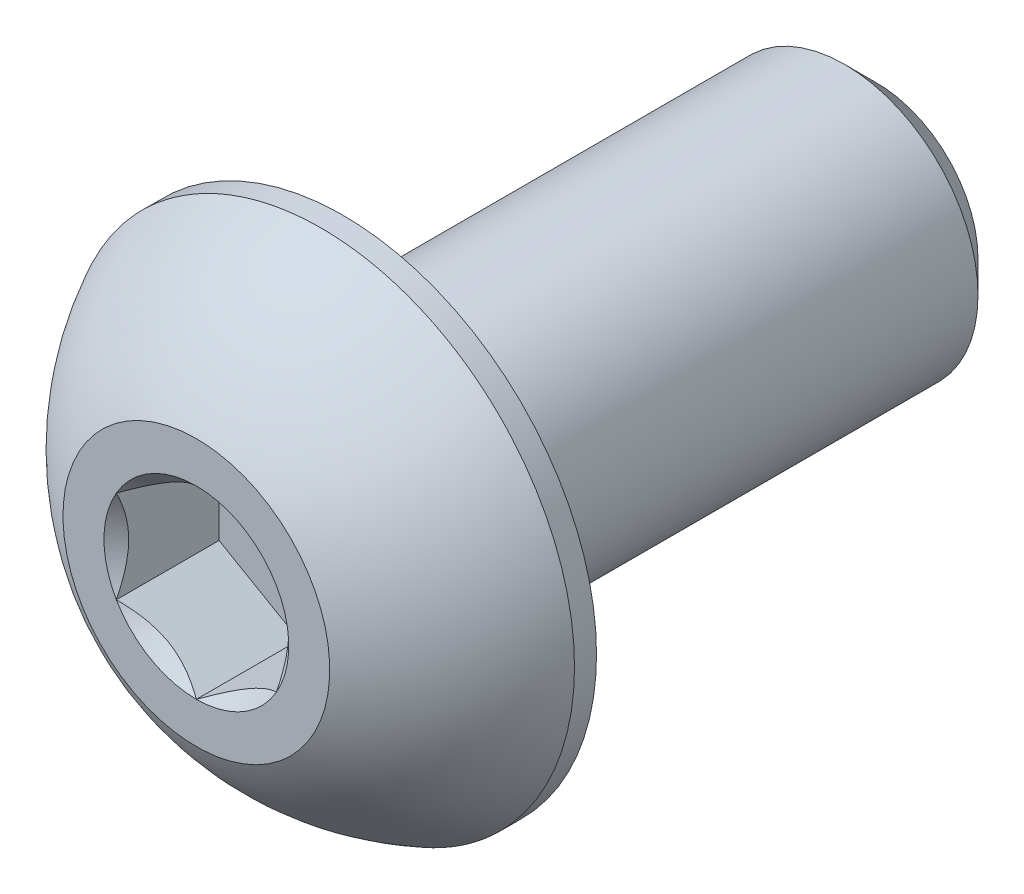
ISO-10303-21;
HEADER;
FILE_DESCRIPTION(('STEP AP214'),'2;1');
FILE_NAME('part.step','',(''),(''),'','','');
FILE_SCHEMA(('AUTOMOTIVE_DESIGN { 1 0 10303 214 1 1 1 1 }'));
ENDSEC;
DATA;
#1=APPLICATION_CONTEXT('core data for automotive mechanical design processes');
#2=APPLICATION_PROTOCOL_DEFINITION('international standard','automotive_design',2000,#1);
#3=PRODUCT_CONTEXT('',#1,'mechanical');
#4=PRODUCT('Part','Part','',(#3));
#5=PRODUCT_RELATED_PRODUCT_CATEGORY('part','',(#4));
#6=PRODUCT_DEFINITION_FORMATION('','',#4);
#7=PRODUCT_DEFINITION_CONTEXT('part definition',#1,'design');
#8=PRODUCT_DEFINITION('design','',#6,#7);
#9=PRODUCT_DEFINITION_SHAPE('','',#8);
#10=(LENGTH_UNIT() NAMED_UNIT(*) SI_UNIT(.MILLI.,.METRE.));
#11=(NAMED_UNIT(*) PLANE_ANGLE_UNIT() SI_UNIT($,.RADIAN.));
#12=(NAMED_UNIT(*) SI_UNIT($,.STERADIAN.) SOLID_ANGLE_UNIT());
#13=UNCERTAINTY_MEASURE_WITH_UNIT(LENGTH_MEASURE(1.E-05),#10,'distance_accuracy_value','');
#14=(GEOMETRIC_REPRESENTATION_CONTEXT(3) GLOBAL_UNCERTAINTY_ASSIGNED_CONTEXT((#13)) GLOBAL_UNIT_ASSIGNED_CONTEXT((#10,
#11,#12)) REPRESENTATION_CONTEXT('',''));
#15=CARTESIAN_POINT('',(0.,0.,0.));
#16=DIRECTION('',(0.,0.,1.));
#17=DIRECTION('',(1.,0.,0.));
#18=AXIS2_PLACEMENT_3D('',#15,#16,#17);
#19=CARTESIAN_POINT('',(1.5,-0.866025403784438,-1.925));
#20=DIRECTION('',(0.,0.,1.));
#21=DIRECTION('',(1.,0.,0.));
#22=AXIS2_PLACEMENT_3D('',#19,#20,#21);
#23=PLANE('',#22);
#24=DIRECTION('',(0.,-1.,0.));
#25=VECTOR('',#24,1.);
#26=CARTESIAN_POINT('',(-1.5,0.866025403784438,-1.925));
#27=LINE('',#26,#25);
#28=CARTESIAN_POINT('',(-1.5,0.866025403784439,-1.925));
#29=VERTEX_POINT('',#28);
#30=CARTESIAN_POINT('',(-1.5,-0.866025403784439,-1.925));
#31=VERTEX_POINT('',#30);
#32=EDGE_CURVE('E67',#29,#31,#27,.T.);
#33=ORIENTED_EDGE('',*,*,#32,.T.);
#34=DIRECTION('',(0.866025403784439,-0.5,0.));
#35=VECTOR('',#34,1.);
#36=CARTESIAN_POINT('',(-1.5,-0.866025403784439,-1.925));
#37=LINE('',#36,#35);
#38=CARTESIAN_POINT('',(0.,-1.73205080756888,-1.925));
#39=VERTEX_POINT('',#38);
#40=EDGE_CURVE('E81',#31,#39,#37,.T.);
#41=ORIENTED_EDGE('',*,*,#40,.T.);
#42=DIRECTION('',(0.866025403784438,0.5,0.));
#43=VECTOR('',#42,1.);
#44=CARTESIAN_POINT('',(0.,-1.73205080756888,-1.925));
#45=LINE('',#44,#43);
#46=CARTESIAN_POINT('',(1.5,-0.86602540378444,-1.925));
#47=VERTEX_POINT('',#46);
#48=EDGE_CURVE('E84',#39,#47,#45,.T.);
#49=ORIENTED_EDGE('',*,*,#48,.T.);
#50=DIRECTION('',(0.,1.,0.));
#51=VECTOR('',#50,1.);
#52=CARTESIAN_POINT('',(1.5,-0.866025403784438,-1.925));
#53=LINE('',#52,#51);
#54=CARTESIAN_POINT('',(1.5,0.866025403784439,-1.925));
#55=VERTEX_POINT('',#54);
#56=EDGE_CURVE('E93',#47,#55,#53,.T.);
#57=ORIENTED_EDGE('',*,*,#56,.T.);
#58=DIRECTION('',(-0.866025403784439,0.5,0.));
#59=VECTOR('',#58,1.);
#60=CARTESIAN_POINT('',(1.5,0.866025403784439,-1.925));
#61=LINE('',#60,#59);
#62=CARTESIAN_POINT('',(0.,1.73205080756888,-1.925));
#63=VERTEX_POINT('',#62);
#64=EDGE_CURVE('E265',#55,#63,#61,.T.);
#65=ORIENTED_EDGE('',*,*,#64,.T.);
#66=DIRECTION('',(-0.866025403784438,-0.5,0.));
#67=VECTOR('',#66,1.);
#68=CARTESIAN_POINT('',(0.,1.73205080756888,-1.925));
#69=LINE('',#68,#67);
#70=EDGE_CURVE('E72',#63,#29,#69,.T.);
#71=ORIENTED_EDGE('',*,*,#70,.T.);
#72=EDGE_LOOP('',(#33,#41,#49,#57,#65,#71));
#73=FACE_BOUND('',#72,.T.);
#74=ADVANCED_FACE('F17',(#73),#23,.T.);
#75=CARTESIAN_POINT('',(-1.5,-0.866025403784439,-1.925));
#76=DIRECTION('',(-0.5,-0.866025403784439,0.));
#77=DIRECTION('',(0.866025403784439,-0.5,0.));
#78=AXIS2_PLACEMENT_3D('',#75,#76,#77);
#79=PLANE('',#78);
#80=CARTESIAN_POINT('',(-1.50000000002453,-0.866025403770049,-3.49737783956075E-11));
#81=CARTESIAN_POINT('',(-1.44844426727117,-0.895791119953617,-0.0297371504849998));
#82=CARTESIAN_POINT('',(-1.39602652187328,-0.926054519369462,-0.05772749973321));
#83=CARTESIAN_POINT('',(-1.28914135977816,-0.987764696477501,-0.108976634295228));
#84=CARTESIAN_POINT('',(-1.23466378385068,-1.01921733960401,-0.132206913925155));
#85=CARTESIAN_POINT('',(-1.12481242363947,-1.08264005199279,-0.172000539063643));
#86=CARTESIAN_POINT('',(-1.06946660011449,-1.11459397810346,-0.188663877355987));
#87=CARTESIAN_POINT('',(-0.95755685533188,-1.17920509937865,-0.214336924391903));
#88=CARTESIAN_POINT('',(-0.900996350293105,-1.21186032218828,-0.223365789908325));
#89=CARTESIAN_POINT('',(-0.803509072843295,-1.26814462806649,-0.231512589340654));
#90=CARTESIAN_POINT('',(-0.762708138141556,-1.29170105869973,-0.232718117543908));
#91=CARTESIAN_POINT('',(-0.68117834074718,-1.33877230917235,-0.230683861819339));
#92=CARTESIAN_POINT('',(-0.640449495964758,-1.36228711867126,-0.22744309593466));
#93=CARTESIAN_POINT('',(-0.559384065201953,-1.40909026694414,-0.216702694706976));
#94=CARTESIAN_POINT('',(-0.519047879504411,-1.4323783746147,-0.20919909909419));
#95=CARTESIAN_POINT('',(-0.439052551258333,-1.47856369891149,-0.19034052638936));
#96=CARTESIAN_POINT('',(-0.399393706909127,-1.50146074337225,-0.178983896683506));
#97=CARTESIAN_POINT('',(-0.297850129661508,-1.56008695503064,-0.145281418581616));
#98=CARTESIAN_POINT('',(-0.236594120185608,-1.59545312859103,-0.120399016466317));
#99=CARTESIAN_POINT('',(-0.146523888893023,-1.64745520087378,-0.0783962697862533));
#100=CARTESIAN_POINT('',(-0.116842951449675,-1.6645914980965,-0.0636393457173693));
#101=CARTESIAN_POINT('',(-0.058026631022432,-1.69854911652791,-0.0327784720806822));
#102=CARTESIAN_POINT('',(-0.0288909964375007,-1.71537058299853,-0.0166751634684281));
#103=CARTESIAN_POINT('',(2.46569689539214E-11,-1.73205080758311,-3.50665873931199E-11));
#104=B_SPLINE_CURVE_WITH_KNOTS('',3,(#80,#81,#82,#83,#84,#85,#86,#87,#88,#89,#90,#91,#92,#93,
#94,#95,#96,#97,#98,#99,#100,#101,#102,#103),.UNSPECIFIED.,.F.,.F.,(4,2,2,2,2,2,2,2,2,2,2,4),
(0.,0.199774419910088,0.400712312277699,0.598459990337993,0.795709985707601,0.936894690871222,
1.07811058146816,1.21945788001607,1.36086588096647,1.58533909988034,1.69726364731887,
1.80913521242832),.UNSPECIFIED.);
#105=CARTESIAN_POINT('',(-1.50000000002135,-0.866025403796765,-2.4650955516094E-11));
#106=VERTEX_POINT('',#105);
#107=CARTESIAN_POINT('',(-3.03586137356069E-11,-1.73205080760065,-1.75293180706268E-11));
#108=VERTEX_POINT('',#107);
#109=EDGE_CURVE('E20',#106,#108,#104,.T.);
#110=ORIENTED_EDGE('',*,*,#109,.T.);
#111=DIRECTION('',(0.,0.,1.));
#112=VECTOR('',#111,1.);
#113=CARTESIAN_POINT('',(0.,-1.73205080756888,-1.925));
#114=LINE('',#113,#112);
#115=EDGE_CURVE('E88',#108,#39,#114,.F.);
#116=ORIENTED_EDGE('',*,*,#115,.T.);
#117=ORIENTED_EDGE('',*,*,#40,.F.);
#118=DIRECTION('',(0.,0.,1.));
#119=VECTOR('',#118,1.);
#120=CARTESIAN_POINT('',(-1.5,-0.866025403784439,-1.925));
#121=LINE('',#120,#119);
#122=EDGE_CURVE('E59',#31,#106,#121,.T.);
#123=ORIENTED_EDGE('',*,*,#122,.T.);
#124=EDGE_LOOP('',(#110,#116,#117,#123));
#125=FACE_BOUND('',#124,.T.);
#126=ADVANCED_FACE('F89',(#125),#79,.F.);
#127=CARTESIAN_POINT('',(0.,-1.73205080756888,-1.925));
#128=DIRECTION('',(0.5,-0.866025403784438,0.));
#129=DIRECTION('',(0.866025403784438,0.5,0.));
#130=AXIS2_PLACEMENT_3D('',#127,#128,#129);
#131=PLANE('',#130);
#132=CARTESIAN_POINT('',(-2.4727404427812E-11,-1.73205080758293,-3.49716199394019E-11));
#133=CARTESIAN_POINT('',(0.0515557327287643,-1.70228509139958,-0.0297371504849976));
#134=CARTESIAN_POINT('',(0.103973478126705,-1.67202169198382,-0.0577274997332079));
#135=CARTESIAN_POINT('',(0.210858640221864,-1.61031151487585,-0.108976634295226));
#136=CARTESIAN_POINT('',(0.26533621614933,-1.57885887174931,-0.132206913925153));
#137=CARTESIAN_POINT('',(0.375187576360525,-1.51543615936052,-0.172000539063641));
#138=CARTESIAN_POINT('',(0.430533399885509,-1.48348223324986,-0.188663877355985));
#139=CARTESIAN_POINT('',(0.542443144668123,-1.41887111197467,-0.214336924391901));
#140=CARTESIAN_POINT('',(0.599003649706897,-1.38621588916504,-0.223365789908323));
#141=CARTESIAN_POINT('',(0.696490927156707,-1.32993158328682,-0.231512589340651));
#142=CARTESIAN_POINT('',(0.737291861858446,-1.30637515265359,-0.232718117543906));
#143=CARTESIAN_POINT('',(0.818821659252822,-1.25930390218097,-0.230683861819337));
#144=CARTESIAN_POINT('',(0.859550504035244,-1.23578909268205,-0.227443095934657));
#145=CARTESIAN_POINT('',(0.940615934798049,-1.18898594440918,-0.216702694706973));
#146=CARTESIAN_POINT('',(0.980952120495592,-1.16569783673862,-0.209199099094188));
#147=CARTESIAN_POINT('',(1.06094744874167,-1.11951251244183,-0.190340526389357));
#148=CARTESIAN_POINT('',(1.10060629309088,-1.09661546798107,-0.178983896683504));
#149=CARTESIAN_POINT('',(1.20214987033849,-1.03798925632268,-0.145281418581613));
#150=CARTESIAN_POINT('',(1.26340587981439,-1.00262308276228,-0.120399016466315));
#151=CARTESIAN_POINT('',(1.35347611110698,-0.950621010479539,-0.0783962697862517));
#152=CARTESIAN_POINT('',(1.38315704855033,-0.933484713256821,-0.063639345717368));
#153=CARTESIAN_POINT('',(1.44197336897757,-0.89952709482541,-0.0327784720806814));
#154=CARTESIAN_POINT('',(1.4711090035625,-0.882705628354789,-0.0166751634684275));
#155=CARTESIAN_POINT('',(1.50000000002466,-0.866025403770207,-3.5066233129564E-11));
#156=B_SPLINE_CURVE_WITH_KNOTS('',3,(#132,#133,#134,#135,#136,#137,#138,#139,#140,#141,#142,
#143,#144,#145,#146,#147,#148,#149,#150,#151,#152,#153,#154,#155),.UNSPECIFIED.,.F.,.F.,(4,2,2,
2,2,2,2,2,2,2,2,4),(0.,0.199774419910088,0.400712312277699,0.598459990337993,0.795709985707601,
0.936894690871222,1.07811058146816,1.21945788001607,1.36086588096647,1.58533909988034,
1.69726364731887,1.80913521242832),.UNSPECIFIED.);
#157=CARTESIAN_POINT('',(1.50000000001233,-0.866025403826621,-1.75289960884086E-11));
#158=VERTEX_POINT('',#157);
#159=EDGE_CURVE('E202',#108,#158,#156,.T.);
#160=ORIENTED_EDGE('',*,*,#159,.T.);
#161=DIRECTION('',(0.,0.,-1.));
#162=VECTOR('',#161,1.);
#163=CARTESIAN_POINT('',(1.5,-0.866025403784439,-1.925));
#164=LINE('',#163,#162);
#165=EDGE_CURVE('E97',#158,#47,#164,.T.);
#166=ORIENTED_EDGE('',*,*,#165,.T.);
#167=ORIENTED_EDGE('',*,*,#48,.F.);
#168=ORIENTED_EDGE('',*,*,#115,.F.);
#169=EDGE_LOOP('',(#160,#166,#167,#168));
#170=FACE_BOUND('',#169,.T.);
#171=ADVANCED_FACE('F95',(#170),#131,.F.);
#172=CARTESIAN_POINT('',(1.5,-0.866025403784438,-1.925));
#173=DIRECTION('',(1.,0.,0.));
#174=DIRECTION('',(0.,0.,-1.));
#175=AXIS2_PLACEMENT_3D('',#172,#173,#174);
#176=PLANE('',#175);
#177=CARTESIAN_POINT('',(1.4999999999998,-0.866025403812882,-3.49731948477309E-11));
#178=CARTESIAN_POINT('',(1.49999999999993,-0.806493971458482,-0.0297371504859724));
#179=CARTESIAN_POINT('',(1.49999999999998,-0.745967172639481,-0.0577274997356717));
#180=CARTESIAN_POINT('',(1.50000000000002,-0.622546818448653,-0.108976634302055));
#181=CARTESIAN_POINT('',(1.50000000000001,-0.559641532208188,-0.132206913934863));
#182=CARTESIAN_POINT('',(1.5,-0.432796107455125,-0.172000539080811));
#183=CARTESIAN_POINT('',(1.5,-0.368888255245699,-0.188663877377684));
#184=CARTESIAN_POINT('',(1.5,-0.239666012718551,-0.214336924424236));
#185=CARTESIAN_POINT('',(1.5,-0.174355567110583,-0.223365789946761));
#186=CARTESIAN_POINT('',(1.5,-0.0617869553803685,-0.231512589389946));
#187=CARTESIAN_POINT('',(1.5,-0.0146740941290635,-0.232718117598397));
#188=CARTESIAN_POINT('',(1.5,0.0794684067864022,-0.230683861885897));
#189=CARTESIAN_POINT('',(1.5,0.126498025769628,-0.227443096008093));
#190=CARTESIAN_POINT('',(1.5,0.220104322286849,-0.216702694795371));
#191=CARTESIAN_POINT('',(1.5,0.266680537614033,-0.209199099190673));
#192=CARTESIAN_POINT('',(1.5,0.359051186180353,-0.190340526502742));
#193=CARTESIAN_POINT('',(1.5,0.404845275088565,-0.178983896805698));
#194=CARTESIAN_POINT('',(1.5,0.522097698449398,-0.145281418704612));
#195=CARTESIAN_POINT('',(1.5,0.592830045625335,-0.120399016572433));
#196=CARTESIAN_POINT('',(1.5,0.69683419026976,-0.0783962698582895));
#197=CARTESIAN_POINT('',(1.5,0.731106784740956,-0.0636393457765502));
#198=CARTESIAN_POINT('',(1.5,0.799022021654026,-0.0327784721118594));
#199=CARTESIAN_POINT('',(1.5,0.832664954619755,-0.0166751634844621));
#200=CARTESIAN_POINT('',(1.5,0.866025403812908,-3.50673015597961E-11));
#201=B_SPLINE_CURVE_WITH_KNOTS('',3,(#177,#178,#179,#180,#181,#182,#183,#184,#185,#186,#187,
#188,#189,#190,#191,#192,#193,#194,#195,#196,#197,#198,#199,#200),.UNSPECIFIED.,.F.,.F.,(4,2,2,
2,2,2,2,2,2,2,2,4),(0.,0.199774419877746,0.400712312213007,0.598459990242251,0.795709985580833,
0.936894690699464,1.07811058125136,1.21945787975417,1.36086588065946,1.58533909974464,
1.69726364726936,1.80913521246463),.UNSPECIFIED.);
#202=CARTESIAN_POINT('',(1.5000000000427,0.866025403774031,-1.75296333077756E-11));
#203=VERTEX_POINT('',#202);
#204=EDGE_CURVE('E184',#158,#203,#201,.T.);
#205=ORIENTED_EDGE('',*,*,#204,.T.);
#206=DIRECTION('',(0.,0.,1.));
#207=VECTOR('',#206,1.);
#208=CARTESIAN_POINT('',(1.5,0.866025403784439,-1.925));
#209=LINE('',#208,#207);
#210=EDGE_CURVE('E262',#203,#55,#209,.F.);
#211=ORIENTED_EDGE('',*,*,#210,.T.);
#212=ORIENTED_EDGE('',*,*,#56,.F.);
#213=ORIENTED_EDGE('',*,*,#165,.F.);
#214=EDGE_LOOP('',(#205,#211,#212,#213));
#215=FACE_BOUND('',#214,.T.);
#216=ADVANCED_FACE('F174',(#215),#176,.F.);
#217=CARTESIAN_POINT('',(1.5,0.866025403784439,-1.925));
#218=DIRECTION('',(0.5,0.866025403784439,0.));
#219=DIRECTION('',(-0.866025403784439,0.5,0.));
#220=AXIS2_PLACEMENT_3D('',#217,#218,#219);
#221=PLANE('',#220);
#222=CARTESIAN_POINT('',(1.50000000002453,0.866025403770048,-3.4973253111955E-11));
#223=CARTESIAN_POINT('',(1.44844426727117,0.895791119953617,-0.0297371504849995));
#224=CARTESIAN_POINT('',(1.39602652187328,0.926054519369461,-0.0577274997332099));
#225=CARTESIAN_POINT('',(1.28914135977816,0.987764696477501,-0.108976634295228));
#226=CARTESIAN_POINT('',(1.23466378385068,1.01921733960401,-0.132206913925156));
#227=CARTESIAN_POINT('',(1.12481242363947,1.08264005199279,-0.172000539063644));
#228=CARTESIAN_POINT('',(1.06946660011449,1.11459397810346,-0.188663877355987));
#229=CARTESIAN_POINT('',(0.95755685533188,1.17920509937865,-0.214336924391904));
#230=CARTESIAN_POINT('',(0.900996350293105,1.21186032218828,-0.223365789908325));
#231=CARTESIAN_POINT('',(0.803509072843295,1.26814462806649,-0.231512589340654));
#232=CARTESIAN_POINT('',(0.762708138141556,1.29170105869973,-0.232718117543908));
#233=CARTESIAN_POINT('',(0.68117834074718,1.33877230917235,-0.230683861819339));
#234=CARTESIAN_POINT('',(0.640449495964758,1.36228711867126,-0.22744309593466));
#235=CARTESIAN_POINT('',(0.559384065201953,1.40909026694414,-0.216702694706976));
#236=CARTESIAN_POINT('',(0.51904787950441,1.4323783746147,-0.20919909909419));
#237=CARTESIAN_POINT('',(0.439052551258333,1.47856369891149,-0.19034052638936));
#238=CARTESIAN_POINT('',(0.399393706909126,1.50146074337225,-0.178983896683506));
#239=CARTESIAN_POINT('',(0.297850129661508,1.56008695503064,-0.145281418581616));
#240=CARTESIAN_POINT('',(0.236594120185608,1.59545312859103,-0.120399016466317));
#241=CARTESIAN_POINT('',(0.146523888893023,1.64745520087378,-0.0783962697862533));
#242=CARTESIAN_POINT('',(0.116842951449675,1.6645914980965,-0.0636393457173695));
#243=CARTESIAN_POINT('',(0.0580266310224324,1.69854911652791,-0.0327784720806825));
#244=CARTESIAN_POINT('',(0.0288909964375013,1.71537058299853,-0.0166751634684285));
#245=CARTESIAN_POINT('',(-2.46561764620561E-11,1.73205080758311,-3.50669956446036E-11));
#246=B_SPLINE_CURVE_WITH_KNOTS('',3,(#222,#223,#224,#225,#226,#227,#228,#229,#230,#231,#232,
#233,#234,#235,#236,#237,#238,#239,#240,#241,#242,#243,#244,#245),.UNSPECIFIED.,.F.,.F.,(4,2,2,
2,2,2,2,2,2,2,2,4),(0.,0.199774419910088,0.400712312277699,0.598459990337994,0.795709985707602,
0.936894690871222,1.07811058146816,1.21945788001607,1.36086588096647,1.58533909988034,
1.69726364731887,1.80913521242832),.UNSPECIFIED.);
#247=CARTESIAN_POINT('',(3.03595659452686E-11,1.73205080760065,-1.75295301999691E-11));
#248=VERTEX_POINT('',#247);
#249=EDGE_CURVE('E178',#203,#248,#246,.T.);
#250=ORIENTED_EDGE('',*,*,#249,.T.);
#251=DIRECTION('',(0.,0.,1.));
#252=VECTOR('',#251,1.);
#253=CARTESIAN_POINT('',(0.,1.73205080756888,-1.925));
#254=LINE('',#253,#252);
#255=EDGE_CURVE('E257',#248,#63,#254,.F.);
#256=ORIENTED_EDGE('',*,*,#255,.T.);
#257=ORIENTED_EDGE('',*,*,#64,.F.);
#258=ORIENTED_EDGE('',*,*,#210,.F.);
#259=EDGE_LOOP('',(#250,#256,#257,#258));
#260=FACE_BOUND('',#259,.T.);
#261=ADVANCED_FACE('F170',(#260),#221,.F.);
#262=CARTESIAN_POINT('',(0.,1.73205080756888,-1.925));
#263=DIRECTION('',(-0.5,0.866025403784438,0.));
#264=DIRECTION('',(-0.866025403784438,-0.5,0.));
#265=AXIS2_PLACEMENT_3D('',#262,#263,#264);
#266=PLANE('',#265);
#267=CARTESIAN_POINT('',(2.47285824502275E-11,1.73205080758293,-3.4971456143468E-11));
#268=CARTESIAN_POINT('',(-0.0515557327287631,1.70228509139958,-0.0297371504849978));
#269=CARTESIAN_POINT('',(-0.103973478126704,1.67202169198382,-0.057727499733208));
#270=CARTESIAN_POINT('',(-0.210858640221863,1.61031151487585,-0.108976634295226));
#271=CARTESIAN_POINT('',(-0.265336216149329,1.57885887174931,-0.132206913925153));
#272=CARTESIAN_POINT('',(-0.375187576360524,1.51543615936052,-0.172000539063641));
#273=CARTESIAN_POINT('',(-0.430533399885509,1.48348223324986,-0.188663877355985));
#274=CARTESIAN_POINT('',(-0.542443144668122,1.41887111197467,-0.214336924391902));
#275=CARTESIAN_POINT('',(-0.599003649706897,1.38621588916503,-0.223365789908323));
#276=CARTESIAN_POINT('',(-0.696490927156706,1.32993158328682,-0.231512589340652));
#277=CARTESIAN_POINT('',(-0.737291861858445,1.30637515265359,-0.232718117543906));
#278=CARTESIAN_POINT('',(-0.818821659252821,1.25930390218097,-0.230683861819337));
#279=CARTESIAN_POINT('',(-0.859550504035243,1.23578909268205,-0.227443095934658));
#280=CARTESIAN_POINT('',(-0.940615934798048,1.18898594440918,-0.216702694706974));
#281=CARTESIAN_POINT('',(-0.980952120495591,1.16569783673862,-0.209199099094188));
#282=CARTESIAN_POINT('',(-1.06094744874167,1.11951251244183,-0.190340526389358));
#283=CARTESIAN_POINT('',(-1.10060629309088,1.09661546798107,-0.178983896683504));
#284=CARTESIAN_POINT('',(-1.20214987033849,1.03798925632268,-0.145281418581613));
#285=CARTESIAN_POINT('',(-1.26340587981439,1.00262308276228,-0.120399016466315));
#286=CARTESIAN_POINT('',(-1.35347611110698,0.950621010479538,-0.0783962697862518));
#287=CARTESIAN_POINT('',(-1.38315704855033,0.933484713256821,-0.0636393457173682));
#288=CARTESIAN_POINT('',(-1.44197336897757,0.899527094825409,-0.0327784720806815));
#289=CARTESIAN_POINT('',(-1.4711090035625,0.882705628354789,-0.0166751634684275));
#290=CARTESIAN_POINT('',(-1.50000000002466,0.866025403770206,-3.50659949264669E-11));
#291=B_SPLINE_CURVE_WITH_KNOTS('',3,(#267,#268,#269,#270,#271,#272,#273,#274,#275,#276,#277,
#278,#279,#280,#281,#282,#283,#284,#285,#286,#287,#288,#289,#290),.UNSPECIFIED.,.F.,.F.,(4,2,2,
2,2,2,2,2,2,2,2,4),(0.,0.199774419910088,0.400712312277699,0.598459990337994,0.795709985707602,
0.936894690871222,1.07811058146816,1.21945788001607,1.36086588096647,1.58533909988034,
1.69726364731887,1.80913521242832),.UNSPECIFIED.);
#292=CARTESIAN_POINT('',(-1.50000000001234,0.86602540382662,-1.75291186124796E-11));
#293=VERTEX_POINT('',#292);
#294=EDGE_CURVE('E40',#248,#293,#291,.T.);
#295=ORIENTED_EDGE('',*,*,#294,.T.);
#296=DIRECTION('',(0.,0.,1.));
#297=VECTOR('',#296,1.);
#298=CARTESIAN_POINT('',(-1.5,0.866025403784438,-1.925));
#299=LINE('',#298,#297);
#300=EDGE_CURVE('E250',#293,#29,#299,.F.);
#301=ORIENTED_EDGE('',*,*,#300,.T.);
#302=ORIENTED_EDGE('',*,*,#70,.F.);
#303=ORIENTED_EDGE('',*,*,#255,.F.);
#304=EDGE_LOOP('',(#295,#301,#302,#303));
#305=FACE_BOUND('',#304,.T.);
#306=ADVANCED_FACE('F163',(#305),#266,.F.);
#307=CARTESIAN_POINT('',(-1.5,0.866025403784438,-1.925));
#308=DIRECTION('',(-1.,0.,0.));
#309=DIRECTION('',(0.,-1.,0.));
#310=AXIS2_PLACEMENT_3D('',#307,#308,#309);
#311=PLANE('',#310);
#312=CARTESIAN_POINT('',(-1.4999999999998,0.866025403812881,-3.4973747365913E-11));
#313=CARTESIAN_POINT('',(-1.49999999999993,0.806493971458482,-0.0297371504859728));
#314=CARTESIAN_POINT('',(-1.49999999999998,0.74596717263948,-0.0577274997356719));
#315=CARTESIAN_POINT('',(-1.50000000000002,0.622546818448652,-0.108976634302056));
#316=CARTESIAN_POINT('',(-1.50000000000001,0.559641532208187,-0.132206913934863));
#317=CARTESIAN_POINT('',(-1.5,0.432796107455125,-0.172000539080811));
#318=CARTESIAN_POINT('',(-1.5,0.368888255245698,-0.188663877377684));
#319=CARTESIAN_POINT('',(-1.5,0.239666012718551,-0.214336924424236));
#320=CARTESIAN_POINT('',(-1.5,0.174355567110582,-0.223365789946761));
#321=CARTESIAN_POINT('',(-1.5,0.0617869553803678,-0.231512589389946));
#322=CARTESIAN_POINT('',(-1.5,0.0146740941290628,-0.232718117598397));
#323=CARTESIAN_POINT('',(-1.5,-0.079468406786403,-0.230683861885897));
#324=CARTESIAN_POINT('',(-1.5,-0.126498025769629,-0.227443096008092));
#325=CARTESIAN_POINT('',(-1.5,-0.220104322286849,-0.21670269479537));
#326=CARTESIAN_POINT('',(-1.5,-0.266680537614034,-0.209199099190673));
#327=CARTESIAN_POINT('',(-1.5,-0.359051186180354,-0.190340526502742));
#328=CARTESIAN_POINT('',(-1.5,-0.404845275088565,-0.178983896805698));
#329=CARTESIAN_POINT('',(-1.5,-0.522097698449399,-0.145281418704611));
#330=CARTESIAN_POINT('',(-1.5,-0.592830045625336,-0.120399016572433));
#331=CARTESIAN_POINT('',(-1.5,-0.69683419026976,-0.0783962698582891));
#332=CARTESIAN_POINT('',(-1.5,-0.731106784740957,-0.0636393457765498));
#333=CARTESIAN_POINT('',(-1.5,-0.799022021654027,-0.0327784721118589));
#334=CARTESIAN_POINT('',(-1.5,-0.832664954619756,-0.0166751634844615));
#335=CARTESIAN_POINT('',(-1.5,-0.866025403812909,-3.50666750779327E-11));
#336=B_SPLINE_CURVE_WITH_KNOTS('',3,(#312,#313,#314,#315,#316,#317,#318,#319,#320,#321,#322,
#323,#324,#325,#326,#327,#328,#329,#330,#331,#332,#333,#334,#335),.UNSPECIFIED.,.F.,.F.,(4,2,2,
2,2,2,2,2,2,2,2,4),(0.,0.199774419877746,0.400712312213007,0.59845999024225,0.795709985580832,
0.936894690699464,1.07811058125136,1.21945787975417,1.36086588065945,1.58533909974464,
1.69726364726936,1.80913521246463),.UNSPECIFIED.);
#337=EDGE_CURVE('E143',#293,#106,#336,.T.);
#338=ORIENTED_EDGE('',*,*,#337,.T.);
#339=ORIENTED_EDGE('',*,*,#122,.F.);
#340=ORIENTED_EDGE('',*,*,#32,.F.);
#341=ORIENTED_EDGE('',*,*,#300,.F.);
#342=EDGE_LOOP('',(#338,#339,#340,#341));
#343=FACE_BOUND('',#342,.T.);
#344=ADVANCED_FACE('F159',(#343),#311,.F.);
#345=CARTESIAN_POINT('',(0.,0.,0.));
#346=DIRECTION('',(0.,0.,1.));
#347=DIRECTION('',(1.,0.,0.));
#348=AXIS2_PLACEMENT_3D('',#345,#346,#347);
#349=CONICAL_SURFACE('',#348,1.73205080761818,0.785398163519197);
#350=ORIENTED_EDGE('',*,*,#109,.F.);
#351=CARTESIAN_POINT('',(0.,0.,0.));
#352=DIRECTION('',(0.,0.,1.));
#353=DIRECTION('',(1.,0.,0.));
#354=AXIS2_PLACEMENT_3D('',#351,#352,#353);
#355=CIRCLE('',#354,1.73205080761818);
#356=EDGE_CURVE('E151',#106,#108,#355,.T.);
#357=ORIENTED_EDGE('',*,*,#356,.T.);
#358=EDGE_LOOP('',(#350,#357));
#359=FACE_BOUND('',#358,.T.);
#360=ADVANCED_FACE('F162',(#359),#349,.F.);
#361=CARTESIAN_POINT('',(0.,0.,0.));
#362=DIRECTION('',(0.,0.,1.));
#363=DIRECTION('',(1.,0.,0.));
#364=AXIS2_PLACEMENT_3D('',#361,#362,#363);
#365=CONICAL_SURFACE('',#364,1.73205080761818,0.785398163519197);
#366=ORIENTED_EDGE('',*,*,#159,.F.);
#367=CARTESIAN_POINT('',(0.,0.,0.));
#368=DIRECTION('',(0.,0.,1.));
#369=DIRECTION('',(1.,0.,0.));
#370=AXIS2_PLACEMENT_3D('',#367,#368,#369);
#371=CIRCLE('',#370,1.73205080761818);
#372=EDGE_CURVE('E303',#108,#158,#371,.T.);
#373=ORIENTED_EDGE('',*,*,#372,.T.);
#374=EDGE_LOOP('',(#366,#373));
#375=FACE_BOUND('',#374,.T.);
#376=ADVANCED_FACE('F197',(#375),#365,.F.);
#377=CARTESIAN_POINT('',(0.,0.,0.));
#378=DIRECTION('',(0.,0.,1.));
#379=DIRECTION('',(1.,0.,0.));
#380=AXIS2_PLACEMENT_3D('',#377,#378,#379);
#381=CONICAL_SURFACE('',#380,1.73205080761818,0.785398163397448);
#382=CARTESIAN_POINT('',(0.,0.,0.));
#383=DIRECTION('',(0.,0.,1.));
#384=DIRECTION('',(1.,0.,0.));
#385=AXIS2_PLACEMENT_3D('',#382,#383,#384);
#386=CIRCLE('',#385,1.73205080761818);
#387=EDGE_CURVE('E304',#158,#203,#386,.T.);
#388=ORIENTED_EDGE('',*,*,#387,.T.);
#389=ORIENTED_EDGE('',*,*,#204,.F.);
#390=EDGE_LOOP('',(#388,#389));
#391=FACE_BOUND('',#390,.T.);
#392=ADVANCED_FACE('F193',(#391),#381,.F.);
#393=CARTESIAN_POINT('',(0.,0.,0.));
#394=DIRECTION('',(0.,0.,1.));
#395=DIRECTION('',(1.,0.,0.));
#396=AXIS2_PLACEMENT_3D('',#393,#394,#395);
#397=CONICAL_SURFACE('',#396,1.73205080761818,0.785398163519197);
#398=ORIENTED_EDGE('',*,*,#249,.F.);
#399=CARTESIAN_POINT('',(0.,0.,0.));
#400=DIRECTION('',(0.,0.,1.));
#401=DIRECTION('',(1.,0.,0.));
#402=AXIS2_PLACEMENT_3D('',#399,#400,#401);
#403=CIRCLE('',#402,1.73205080761818);
#404=EDGE_CURVE('E305',#203,#248,#403,.T.);
#405=ORIENTED_EDGE('',*,*,#404,.T.);
#406=EDGE_LOOP('',(#398,#405));
#407=FACE_BOUND('',#406,.T.);
#408=ADVANCED_FACE('F190',(#407),#397,.F.);
#409=CARTESIAN_POINT('',(0.,0.,0.));
#410=DIRECTION('',(0.,0.,1.));
#411=DIRECTION('',(1.,0.,0.));
#412=AXIS2_PLACEMENT_3D('',#409,#410,#411);
#413=CONICAL_SURFACE('',#412,1.73205080761818,0.785398163519197);
#414=ORIENTED_EDGE('',*,*,#294,.F.);
#415=CARTESIAN_POINT('',(0.,0.,0.));
#416=DIRECTION('',(0.,0.,1.));
#417=DIRECTION('',(1.,0.,0.));
#418=AXIS2_PLACEMENT_3D('',#415,#416,#417);
#419=CIRCLE('',#418,1.73205080761818);
#420=EDGE_CURVE('E298',#248,#293,#419,.T.);
#421=ORIENTED_EDGE('',*,*,#420,.T.);
#422=EDGE_LOOP('',(#414,#421));
#423=FACE_BOUND('',#422,.T.);
#424=ADVANCED_FACE('F138',(#423),#413,.F.);
#425=CARTESIAN_POINT('',(0.,0.,0.));
#426=DIRECTION('',(0.,0.,1.));
#427=DIRECTION('',(1.,0.,0.));
#428=AXIS2_PLACEMENT_3D('',#425,#426,#427);
#429=CONICAL_SURFACE('',#428,1.73205080761818,0.785398163397448);
#430=ORIENTED_EDGE('',*,*,#337,.F.);
#431=CARTESIAN_POINT('',(0.,0.,0.));
#432=DIRECTION('',(0.,0.,1.));
#433=DIRECTION('',(1.,0.,0.));
#434=AXIS2_PLACEMENT_3D('',#431,#432,#433);
#435=CIRCLE('',#434,1.73205080761818);
#436=EDGE_CURVE('E123',#293,#106,#435,.T.);
#437=ORIENTED_EDGE('',*,*,#436,.T.);
#438=EDGE_LOOP('',(#430,#437));
#439=FACE_BOUND('',#438,.T.);
#440=ADVANCED_FACE('F133',(#439),#429,.F.);
#441=CARTESIAN_POINT('',(0.,-2.5,0.));
#442=DIRECTION('',(0.,0.,-1.));
#443=DIRECTION('',(-1.,0.,0.));
#444=AXIS2_PLACEMENT_3D('',#441,#442,#443);
#445=PLANE('',#444);
#446=ORIENTED_EDGE('',*,*,#420,.F.);
#447=ORIENTED_EDGE('',*,*,#404,.F.);
#448=ORIENTED_EDGE('',*,*,#387,.F.);
#449=ORIENTED_EDGE('',*,*,#372,.F.);
#450=ORIENTED_EDGE('',*,*,#356,.F.);
#451=ORIENTED_EDGE('',*,*,#436,.F.);
#452=EDGE_LOOP('',(#446,#447,#448,#449,#450,#451));
#453=FACE_BOUND('',#452,.T.);
#454=CARTESIAN_POINT('',(0.,2.5,0.));
#455=CARTESIAN_POINT('',(-0.14042610491617,2.49999377288615,0.));
#456=CARTESIAN_POINT('',(-0.280954031991962,2.48812860484106,3.15837073548596E-13));
#457=CARTESIAN_POINT('',(-0.558139658492381,2.44096074902969,-3.16217430406192E-13));
#458=CARTESIAN_POINT('',(-0.694792493265143,2.40562985309161,-1.19919020739016E-12));
#459=CARTESIAN_POINT('',(-0.960172122561447,2.31253633023374,-1.20166649233908E-12));
#460=CARTESIAN_POINT('',(-1.08890266852496,2.25478441650809,-3.22011383776226E-13));
#461=CARTESIAN_POINT('',(-1.33480476215494,2.11850293856874,3.2193136886496E-13));
#462=CARTESIAN_POINT('',(-1.45197917410754,2.03997854084975,0.));
#463=CARTESIAN_POINT('',(-1.67149637287937,1.86436525899232,0.));
#464=CARTESIAN_POINT('',(-1.77383760642256,1.76727443311113,0.));
#465=CARTESIAN_POINT('',(-1.96077108972063,1.5572853703438,0.));
#466=CARTESIAN_POINT('',(-2.04536264247664,1.44438651299412,0.));
#467=CARTESIAN_POINT('',(-2.19438926048052,1.20599153577204,0.));
#468=CARTESIAN_POINT('',(-2.2588247010994,1.08049565055392,0.));
#469=CARTESIAN_POINT('',(-2.36571190425968,0.82046757520664,0.));
#470=CARTESIAN_POINT('',(-2.40816371100576,0.685935403248263,0.));
#471=CARTESIAN_POINT('',(-2.46987884513361,0.411653235766079,0.));
#472=CARTESIAN_POINT('',(-2.4891421283097,0.271903230295725,0.));
#473=CARTESIAN_POINT('',(-2.50393321907299,-0.0088470093858576,0.));
#474=CARTESIAN_POINT('',(-2.49946106942909,-0.149847241343845,0.));
#475=CARTESIAN_POINT('',(-2.46690834048228,-0.429095661105702,0.));
#476=CARTESIAN_POINT('',(-2.43882775236998,-0.567343847882636,0.));
#477=CARTESIAN_POINT('',(-2.35985521676827,-0.837163810231989,0.));
#478=CARTESIAN_POINT('',(-2.30896324519902,-0.968735578756572,0.));
#479=CARTESIAN_POINT('',(-2.1858126315262,-1.2214675666181,0.));
#480=CARTESIAN_POINT('',(-2.11355399637579,-1.34262778934316,0.));
#481=CARTESIAN_POINT('',(-1.94972129370707,-1.57109730355804,0.));
#482=CARTESIAN_POINT('',(-1.85814723400701,-1.67840660065422,0.));
#483=CARTESIAN_POINT('',(-1.65828316813495,-1.87612814061528,0.));
#484=CARTESIAN_POINT('',(-1.54999315967219,-1.96654038116456,0.));
#485=CARTESIAN_POINT('',(-1.31977122488188,-2.12790126296045,0.));
#486=CARTESIAN_POINT('',(-1.19783929677157,-2.1988499016635,0.));
#487=CARTESIAN_POINT('',(-0.943794829063064,-2.31926953799949,0.));
#488=CARTESIAN_POINT('',(-0.811682289900767,-2.36874053655201,0.));
#489=CARTESIAN_POINT('',(-0.541026888337529,-2.44480055905628,0.));
#490=CARTESIAN_POINT('',(-0.402484026226277,-2.47138958403887,0.));
#491=CARTESIAN_POINT('',(-0.122900797575725,-2.50093087897621,0.));
#492=CARTESIAN_POINT('',(0.0181395689635721,-2.50388314893098,3.46928746598396E-13));
#493=CARTESIAN_POINT('',(0.298714091660325,-2.48606712714886,-3.46928762227747E-13));
#494=CARTESIAN_POINT('',(0.438248247749924,-2.46529883434335,-1.29476413739446E-12));
#495=CARTESIAN_POINT('',(0.711849384339791,-2.40063123468837,-1.13731817255432E-12));
#496=CARTESIAN_POINT('',(0.845916364605969,-2.3567319268485,0.));
#497=CARTESIAN_POINT('',(1.10477735834655,-2.24704847617179,0.));
#498=CARTESIAN_POINT('',(1.22957137303277,-2.18126433619494,-1.00917092186277E-12));
#499=CARTESIAN_POINT('',(1.46634390401786,-2.02967864834022,-1.18351953982553E-12));
#500=CARTESIAN_POINT('',(1.57832242207297,-1.94387710320556,-3.16660756955316E-13));
#501=CARTESIAN_POINT('',(1.7862852822064,-1.7546922142879,3.16660885129013E-13));
#502=CARTESIAN_POINT('',(1.8822696178108,-1.6513088633884,0.));
#503=CARTESIAN_POINT('',(2.0555193719421,-1.42989510132749,0.));
#504=CARTESIAN_POINT('',(2.13278478437747,-1.31186468539964,0.));
#505=CARTESIAN_POINT('',(2.2664032406088,-1.06450749101074,0.));
#506=CARTESIAN_POINT('',(2.32275630647994,-0.935180724474359,0.));
#507=CARTESIAN_POINT('',(2.41295047224872,-0.668901974735228,0.));
#508=CARTESIAN_POINT('',(2.4467915805466,-0.531949994377823,0.));
#509=CARTESIAN_POINT('',(2.49100125494042,-0.254308178115882,0.));
#510=CARTESIAN_POINT('',(2.50136977874099,-0.113618335476537,0.));
#511=CARTESIAN_POINT('',(2.49833983643023,0.167504919749229,0.));
#512=CARTESIAN_POINT('',(2.48494141562714,0.307938332823986,0.));
#513=CARTESIAN_POINT('',(2.43475793877014,0.584562794538378,0.));
#514=CARTESIAN_POINT('',(2.39797283569016,0.72075383464685,0.));
#515=CARTESIAN_POINT('',(2.30205936796063,0.985029646530052,0.));
#516=CARTESIAN_POINT('',(2.24293058718862,1.11311426728121,0.));
#517=CARTESIAN_POINT('',(2.10401075902967,1.3575336098139,0.));
#518=CARTESIAN_POINT('',(2.02422052292125,1.47386879269155,0.));
#519=CARTESIAN_POINT('',(1.84625229096995,1.69148114008358,0.));
#520=CARTESIAN_POINT('',(1.74807621990901,1.79275987884253,0.));
#521=CARTESIAN_POINT('',(1.53608575842464,1.97742315380663,0.));
#522=CARTESIAN_POINT('',(1.42226748721669,2.06080323621403,0.));
#523=CARTESIAN_POINT('',(1.18220372565671,2.20730286771333,0.));
#524=CARTESIAN_POINT('',(1.05595232774905,2.27041272419885,0.));
#525=CARTESIAN_POINT('',(0.794745243184761,2.37446817640477,0.));
#526=CARTESIAN_POINT('',(0.659800208998089,2.41544034072841,0.));
#527=CARTESIAN_POINT('',(0.436662637238998,2.46313736176947,0.));
#528=CARTESIAN_POINT('',(0.349919997758221,2.47694359911888,0.));
#529=CARTESIAN_POINT('',(0.175464826042706,2.49537686389633,0.));
#530=CARTESIAN_POINT('',(0.0877522938079668,2.50000389132438,0.));
#531=CARTESIAN_POINT('',(0.,2.5,0.));
#532=B_SPLINE_CURVE_WITH_KNOTS('',3,(#454,#455,#456,#457,#458,#459,#460,#461,#462,#463,#464,
#465,#466,#467,#468,#469,#470,#471,#472,#473,#474,#475,#476,#477,#478,#479,#480,#481,#482,#483,
#484,#485,#486,#487,#488,#489,#490,#491,#492,#493,#494,#495,#496,#497,#498,#499,#500,#501,#502,
#503,#504,#505,#506,#507,#508,#509,#510,#511,#512,#513,#514,#515,#516,#517,#518,#519,#520,#521,
#522,#523,#524,#525,#526,#527,#528,#529,#530,#531),.UNSPECIFIED.,.T.,.F.,(4,2,2,2,2,2,2,2,2,2,2,
2,2,2,2,2,2,2,2,2,2,2,2,2,2,2,2,2,2,2,2,2,2,2,2,2,2,2,4),(0.,0.420958019059747,
0.842422990224611,1.26368682467408,1.68484598149402,2.10604920874208,2.52726897280857,
2.94848089195443,3.36969196412426,3.7909038392729,4.21211495543997,4.63332622878055,
5.05453794675567,5.47574952765963,5.89696093807137,6.31817240620663,6.73938392938708,
7.16059543453285,7.58180692070278,8.00301840687236,8.42422991201778,8.84544143519829,
9.26665290333358,9.68786431374594,10.1090758946506,10.5302876126258,10.9514988859663,
11.3727100021334,11.793921877282,12.2151329494518,12.6363448685977,13.0575646326643,
13.4787678599123,13.8999270167319,14.3211908511815,14.742655822347,15.1636138414069,
15.4266705700074,15.689727298608),.UNSPECIFIED.);
#533=CARTESIAN_POINT('',(0.,2.5,0.));
#534=VERTEX_POINT('',#533);
#535=EDGE_CURVE('E115',#534,#534,#532,.F.);
#536=ORIENTED_EDGE('',*,*,#535,.F.);
#537=EDGE_LOOP('',(#536));
#538=FACE_BOUND('',#537,.T.);
#539=ADVANCED_FACE('F129',(#453,#538),#445,.F.);
#540=CARTESIAN_POINT('',(0.,0.,-4.65805481283422));
#541=DIRECTION('',(0.,-1.,0.));
#542=DIRECTION('',(0.,0.,-1.));
#543=AXIS2_PLACEMENT_3D('',#540,#541,#542);
#544=SPHERICAL_SURFACE('',#543,5.28653711226622);
#545=ORIENTED_EDGE('',*,*,#535,.T.);
#546=EDGE_LOOP('',(#545));
#547=FACE_BOUND('',#546,.T.);
#548=CARTESIAN_POINT('',(0.,0.,-2.3375));
#549=DIRECTION('',(0.,0.,1.));
#550=DIRECTION('',(1.,0.,0.));
#551=AXIS2_PLACEMENT_3D('',#548,#549,#550);
#552=CIRCLE('',#551,4.75);
#553=CARTESIAN_POINT('',(4.75,0.,-2.3375));
#554=VERTEX_POINT('',#553);
#555=EDGE_CURVE('E112',#554,#554,#552,.F.);
#556=ORIENTED_EDGE('',*,*,#555,.F.);
#557=EDGE_LOOP('',(#556));
#558=FACE_BOUND('',#557,.T.);
#559=ADVANCED_FACE('F125',(#547,#558),#544,.T.);
#560=CARTESIAN_POINT('',(0.,-2.50000000000001,-12.75));
#561=DIRECTION('',(0.,0.,-1.));
#562=DIRECTION('',(0.,1.,0.));
#563=AXIS2_PLACEMENT_3D('',#560,#561,#562);
#564=PLANE('',#563);
#565=CARTESIAN_POINT('',(0.,0.,-12.7499999999259));
#566=DIRECTION('',(0.,0.,1.));
#567=DIRECTION('',(1.,0.,0.));
#568=AXIS2_PLACEMENT_3D('',#565,#566,#567);
#569=CIRCLE('',#568,1.90000000003465);
#570=CARTESIAN_POINT('',(1.90000000003465,0.,-12.7499999999259));
#571=VERTEX_POINT('',#570);
#572=EDGE_CURVE('E109',#571,#571,#569,.T.);
#573=ORIENTED_EDGE('',*,*,#572,.F.);
#574=EDGE_LOOP('',(#573));
#575=FACE_BOUND('',#574,.T.);
#576=ADVANCED_FACE('F233',(#575),#564,.T.);
#577=CARTESIAN_POINT('',(0.,0.,0.));
#578=DIRECTION('',(0.,0.,1.));
#579=DIRECTION('',(1.,0.,0.));
#580=AXIS2_PLACEMENT_3D('',#577,#578,#579);
#581=CYLINDRICAL_SURFACE('',#580,4.75);
#582=CARTESIAN_POINT('',(0.,0.,-2.75));
#583=DIRECTION('',(0.,0.,1.));
#584=DIRECTION('',(1.,0.,0.));
#585=AXIS2_PLACEMENT_3D('',#582,#583,#584);
#586=CIRCLE('',#585,4.75);
#587=CARTESIAN_POINT('',(4.75,0.,-2.75));
#588=VERTEX_POINT('',#587);
#589=EDGE_CURVE('E106',#588,#588,#586,.T.);
#590=ORIENTED_EDGE('',*,*,#589,.T.);
#591=EDGE_LOOP('',(#590));
#592=FACE_BOUND('',#591,.T.);
#593=ORIENTED_EDGE('',*,*,#555,.T.);
#594=EDGE_LOOP('',(#593));
#595=FACE_BOUND('',#594,.T.);
#596=ADVANCED_FACE('F230',(#592,#595),#581,.T.);
#597=CARTESIAN_POINT('',(0.,0.,-12.1500000000765));
#598=DIRECTION('',(0.,0.,1.));
#599=DIRECTION('',(1.,0.,0.));
#600=AXIS2_PLACEMENT_3D('',#597,#598,#599);
#601=CONICAL_SURFACE('',#600,2.49999999988404,0.785398163397448);
#602=ORIENTED_EDGE('',*,*,#572,.T.);
#603=EDGE_LOOP('',(#602));
#604=FACE_BOUND('',#603,.T.);
#605=CARTESIAN_POINT('',(0.,0.,-12.15));
#606=DIRECTION('',(0.,0.,-1.));
#607=DIRECTION('',(0.,1.,0.));
#608=AXIS2_PLACEMENT_3D('',#605,#606,#607);
#609=CIRCLE('',#608,2.5);
#610=CARTESIAN_POINT('',(0.,2.5,-12.15));
#611=VERTEX_POINT('',#610);
#612=EDGE_CURVE('E31',#611,#611,#609,.F.);
#613=ORIENTED_EDGE('',*,*,#612,.F.);
#614=EDGE_LOOP('',(#613));
#615=FACE_BOUND('',#614,.T.);
#616=ADVANCED_FACE('F223',(#604,#615),#601,.T.);
#617=CARTESIAN_POINT('',(0.,-4.75,-2.75));
#618=DIRECTION('',(0.,0.,1.));
#619=DIRECTION('',(1.,0.,0.));
#620=AXIS2_PLACEMENT_3D('',#617,#618,#619);
#621=PLANE('',#620);
#622=CARTESIAN_POINT('',(0.,0.,-2.75));
#623=DIRECTION('',(0.,0.,-1.));
#624=DIRECTION('',(0.,1.,0.));
#625=AXIS2_PLACEMENT_3D('',#622,#623,#624);
#626=CIRCLE('',#625,2.5);
#627=CARTESIAN_POINT('',(0.,2.5,-2.75));
#628=VERTEX_POINT('',#627);
#629=EDGE_CURVE('E11',#628,#628,#626,.T.);
#630=ORIENTED_EDGE('',*,*,#629,.F.);
#631=EDGE_LOOP('',(#630));
#632=FACE_BOUND('',#631,.T.);
#633=ORIENTED_EDGE('',*,*,#589,.F.);
#634=EDGE_LOOP('',(#633));
#635=FACE_BOUND('',#634,.T.);
#636=ADVANCED_FACE('F217',(#632,#635),#621,.F.);
#637=CARTESIAN_POINT('',(0.,0.,-12.75));
#638=DIRECTION('',(0.,0.,-1.));
#639=DIRECTION('',(0.,1.,0.));
#640=AXIS2_PLACEMENT_3D('',#637,#638,#639);
#641=CYLINDRICAL_SURFACE('',#640,2.5);
#642=ORIENTED_EDGE('',*,*,#629,.T.);
#643=EDGE_LOOP('',(#642));
#644=FACE_BOUND('',#643,.T.);
#645=ORIENTED_EDGE('',*,*,#612,.T.);
#646=EDGE_LOOP('',(#645));
#647=FACE_BOUND('',#646,.T.);
#648=ADVANCED_FACE('F215',(#644,#647),#641,.T.);
#649=CLOSED_SHELL('',(#74,#126,#171,#216,#261,#306,#344,#360,#376,#392,#408,#424,#440,#539,#559,
#576,#596,#616,#636,#648));
#650=MANIFOLD_SOLID_BREP('B1',#649);
#651=ADVANCED_BREP_SHAPE_REPRESENTATION('',(#18,#650),#14);
#652=SHAPE_DEFINITION_REPRESENTATION(#9,#651);
ENDSEC;
END-ISO-10303-21;
